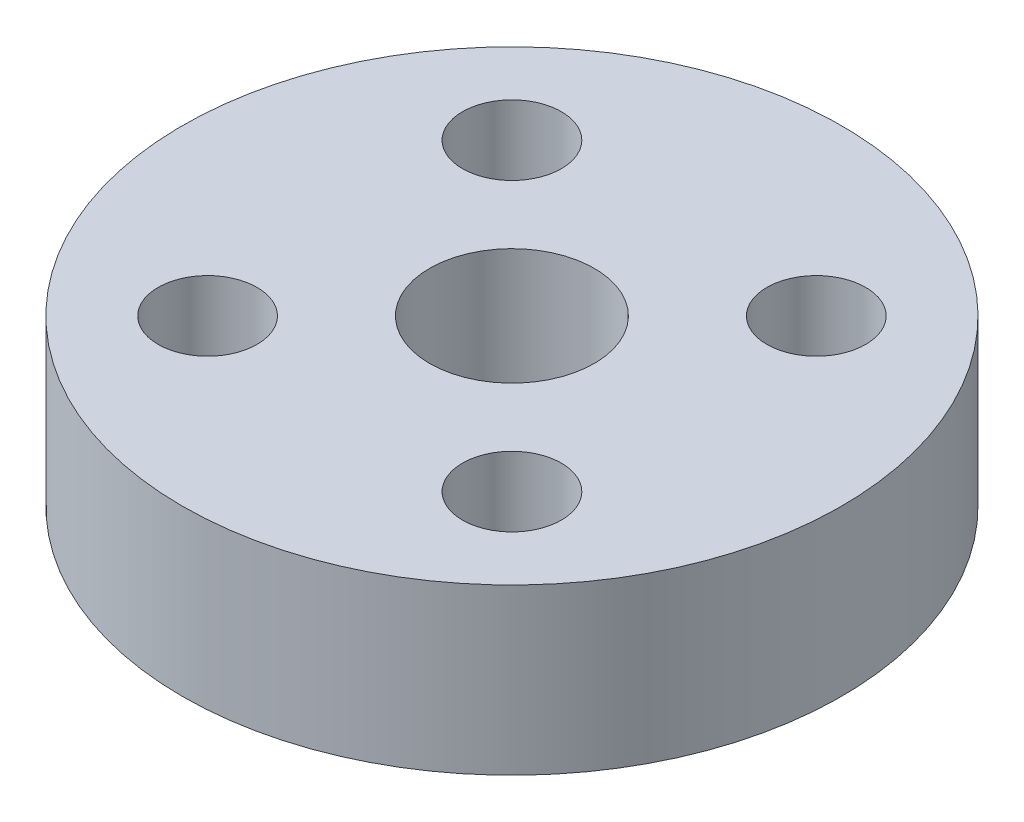
ISO-10303-21;
HEADER;
FILE_DESCRIPTION(('STEP AP214'),'2;1');
FILE_NAME('part.step','',(''),(''),'','','');
FILE_SCHEMA(('AUTOMOTIVE_DESIGN { 1 0 10303 214 1 1 1 1 }'));
ENDSEC;
DATA;
#1=APPLICATION_CONTEXT('core data for automotive mechanical design processes');
#2=APPLICATION_PROTOCOL_DEFINITION('international standard','automotive_design',2000,#1);
#3=PRODUCT_CONTEXT('',#1,'mechanical');
#4=PRODUCT('Part','Part','',(#3));
#5=PRODUCT_RELATED_PRODUCT_CATEGORY('part','',(#4));
#6=PRODUCT_DEFINITION_FORMATION('','',#4);
#7=PRODUCT_DEFINITION_CONTEXT('part definition',#1,'design');
#8=PRODUCT_DEFINITION('design','',#6,#7);
#9=PRODUCT_DEFINITION_SHAPE('','',#8);
#10=(LENGTH_UNIT() NAMED_UNIT(*) SI_UNIT(.MILLI.,.METRE.));
#11=(NAMED_UNIT(*) PLANE_ANGLE_UNIT() SI_UNIT($,.RADIAN.));
#12=(NAMED_UNIT(*) SI_UNIT($,.STERADIAN.) SOLID_ANGLE_UNIT());
#13=UNCERTAINTY_MEASURE_WITH_UNIT(LENGTH_MEASURE(1.E-05),#10,'distance_accuracy_value','');
#14=(GEOMETRIC_REPRESENTATION_CONTEXT(3) GLOBAL_UNCERTAINTY_ASSIGNED_CONTEXT((#13)) GLOBAL_UNIT_ASSIGNED_CONTEXT((#10,
#11,#12)) REPRESENTATION_CONTEXT('',''));
#15=CARTESIAN_POINT('',(0.,0.,0.));
#16=DIRECTION('',(0.,0.,1.));
#17=DIRECTION('',(1.,0.,0.));
#18=AXIS2_PLACEMENT_3D('',#15,#16,#17);
#19=CARTESIAN_POINT('',(-4.61740728114789,5.,4.61740728114842));
#20=DIRECTION('',(0.,-1.,0.));
#21=DIRECTION('',(0.,0.,-1.));
#22=AXIS2_PLACEMENT_3D('',#19,#20,#21);
#23=CYLINDRICAL_SURFACE('',#22,1.50000000000019);
#24=CARTESIAN_POINT('',(-4.61740728114789,5.,4.61740728114842));
#25=DIRECTION('',(0.,1.,0.));
#26=DIRECTION('',(0.,0.,1.));
#27=AXIS2_PLACEMENT_3D('',#24,#25,#26);
#28=CIRCLE('',#27,1.50000000000019);
#29=CARTESIAN_POINT('',(-4.61740728114789,5.,6.11740728114861));
#30=VERTEX_POINT('',#29);
#31=EDGE_CURVE('E40',#30,#30,#28,.T.);
#32=ORIENTED_EDGE('',*,*,#31,.T.);
#33=EDGE_LOOP('',(#32));
#34=FACE_BOUND('',#33,.T.);
#35=CARTESIAN_POINT('',(-4.61740728114789,0.,4.61740728114842));
#36=DIRECTION('',(0.,1.,0.));
#37=DIRECTION('',(0.,0.,1.));
#38=AXIS2_PLACEMENT_3D('',#35,#36,#37);
#39=CIRCLE('',#38,1.50000000000019);
#40=CARTESIAN_POINT('',(-4.61740728114789,0.,6.11740728114861));
#41=VERTEX_POINT('',#40);
#42=EDGE_CURVE('E60',#41,#41,#39,.T.);
#43=ORIENTED_EDGE('',*,*,#42,.F.);
#44=EDGE_LOOP('',(#43));
#45=FACE_BOUND('',#44,.T.);
#46=ADVANCED_FACE('F32',(#34,#45),#23,.F.);
#47=CARTESIAN_POINT('',(-4.61740728114816,5.,-4.61740728114789));
#48=DIRECTION('',(0.,-1.,0.));
#49=DIRECTION('',(0.,0.,-1.));
#50=AXIS2_PLACEMENT_3D('',#47,#48,#49);
#51=CYLINDRICAL_SURFACE('',#50,1.50000000000028);
#52=CARTESIAN_POINT('',(-4.61740728114816,5.,-4.61740728114789));
#53=DIRECTION('',(0.,1.,0.));
#54=DIRECTION('',(0.,0.,1.));
#55=AXIS2_PLACEMENT_3D('',#52,#53,#54);
#56=CIRCLE('',#55,1.50000000000028);
#57=CARTESIAN_POINT('',(-4.61740728114816,5.,-3.11740728114761));
#58=VERTEX_POINT('',#57);
#59=EDGE_CURVE('E45',#58,#58,#56,.T.);
#60=ORIENTED_EDGE('',*,*,#59,.T.);
#61=EDGE_LOOP('',(#60));
#62=FACE_BOUND('',#61,.T.);
#63=CARTESIAN_POINT('',(-4.61740728114816,0.,-4.61740728114789));
#64=DIRECTION('',(0.,1.,0.));
#65=DIRECTION('',(0.,0.,1.));
#66=AXIS2_PLACEMENT_3D('',#63,#64,#65);
#67=CIRCLE('',#66,1.50000000000028);
#68=CARTESIAN_POINT('',(-4.61740728114816,0.,-3.11740728114761));
#69=VERTEX_POINT('',#68);
#70=EDGE_CURVE('E58',#69,#69,#67,.T.);
#71=ORIENTED_EDGE('',*,*,#70,.F.);
#72=EDGE_LOOP('',(#71));
#73=FACE_BOUND('',#72,.T.);
#74=ADVANCED_FACE('F81',(#62,#73),#51,.F.);
#75=CARTESIAN_POINT('',(0.,5.,0.));
#76=DIRECTION('',(0.,-1.,0.));
#77=DIRECTION('',(0.,0.,-1.));
#78=AXIS2_PLACEMENT_3D('',#75,#76,#77);
#79=CYLINDRICAL_SURFACE('',#78,2.5);
#80=CARTESIAN_POINT('',(0.,5.,0.));
#81=DIRECTION('',(0.,1.,0.));
#82=DIRECTION('',(0.,0.,1.));
#83=AXIS2_PLACEMENT_3D('',#80,#81,#82);
#84=CIRCLE('',#83,2.5);
#85=CARTESIAN_POINT('',(0.,5.,2.5));
#86=VERTEX_POINT('',#85);
#87=EDGE_CURVE('E74',#86,#86,#84,.T.);
#88=ORIENTED_EDGE('',*,*,#87,.T.);
#89=EDGE_LOOP('',(#88));
#90=FACE_BOUND('',#89,.T.);
#91=CARTESIAN_POINT('',(0.,0.,0.));
#92=DIRECTION('',(0.,1.,0.));
#93=DIRECTION('',(0.,0.,1.));
#94=AXIS2_PLACEMENT_3D('',#91,#92,#93);
#95=CIRCLE('',#94,2.5);
#96=CARTESIAN_POINT('',(0.,0.,2.5));
#97=VERTEX_POINT('',#96);
#98=EDGE_CURVE('E55',#97,#97,#95,.T.);
#99=ORIENTED_EDGE('',*,*,#98,.F.);
#100=EDGE_LOOP('',(#99));
#101=FACE_BOUND('',#100,.T.);
#102=ADVANCED_FACE('F99',(#90,#101),#79,.F.);
#103=CARTESIAN_POINT('',(4.61740728114815,5.,-4.61740728114816));
#104=DIRECTION('',(0.,-1.,0.));
#105=DIRECTION('',(0.,0.,-1.));
#106=AXIS2_PLACEMENT_3D('',#103,#104,#105);
#107=CYLINDRICAL_SURFACE('',#106,1.5);
#108=CARTESIAN_POINT('',(4.61740728114815,5.,-4.61740728114816));
#109=DIRECTION('',(0.,1.,0.));
#110=DIRECTION('',(0.,0.,1.));
#111=AXIS2_PLACEMENT_3D('',#108,#109,#110);
#112=CIRCLE('',#111,1.5);
#113=CARTESIAN_POINT('',(4.61740728114815,5.,-3.11740728114816));
#114=VERTEX_POINT('',#113);
#115=EDGE_CURVE('E69',#114,#114,#112,.T.);
#116=ORIENTED_EDGE('',*,*,#115,.T.);
#117=EDGE_LOOP('',(#116));
#118=FACE_BOUND('',#117,.T.);
#119=CARTESIAN_POINT('',(4.61740728114815,0.,-4.61740728114816));
#120=DIRECTION('',(0.,1.,0.));
#121=DIRECTION('',(0.,0.,1.));
#122=AXIS2_PLACEMENT_3D('',#119,#120,#121);
#123=CIRCLE('',#122,1.5);
#124=CARTESIAN_POINT('',(4.61740728114815,0.,-3.11740728114816));
#125=VERTEX_POINT('',#124);
#126=EDGE_CURVE('E52',#125,#125,#123,.T.);
#127=ORIENTED_EDGE('',*,*,#126,.F.);
#128=EDGE_LOOP('',(#127));
#129=FACE_BOUND('',#128,.T.);
#130=ADVANCED_FACE('F105',(#118,#129),#107,.F.);
#131=CARTESIAN_POINT('',(0.,5.,0.));
#132=DIRECTION('',(0.,-1.,0.));
#133=DIRECTION('',(0.,0.,-1.));
#134=AXIS2_PLACEMENT_3D('',#131,#132,#133);
#135=CYLINDRICAL_SURFACE('',#134,10.);
#136=CARTESIAN_POINT('',(0.,5.,0.));
#137=DIRECTION('',(0.,1.,0.));
#138=DIRECTION('',(0.,0.,1.));
#139=AXIS2_PLACEMENT_3D('',#136,#137,#138);
#140=CIRCLE('',#139,10.);
#141=CARTESIAN_POINT('',(0.,5.,10.));
#142=VERTEX_POINT('',#141);
#143=EDGE_CURVE('E65',#142,#142,#140,.T.);
#144=ORIENTED_EDGE('',*,*,#143,.F.);
#145=EDGE_LOOP('',(#144));
#146=FACE_BOUND('',#145,.T.);
#147=CARTESIAN_POINT('',(0.,0.,0.));
#148=DIRECTION('',(0.,1.,0.));
#149=DIRECTION('',(0.,0.,1.));
#150=AXIS2_PLACEMENT_3D('',#147,#148,#149);
#151=CIRCLE('',#150,10.);
#152=CARTESIAN_POINT('',(0.,0.,10.));
#153=VERTEX_POINT('',#152);
#154=EDGE_CURVE('E49',#153,#153,#151,.T.);
#155=ORIENTED_EDGE('',*,*,#154,.T.);
#156=EDGE_LOOP('',(#155));
#157=FACE_BOUND('',#156,.T.);
#158=ADVANCED_FACE('F34',(#146,#157),#135,.T.);
#159=CARTESIAN_POINT('',(4.61740728114842,5.,4.61740728114815));
#160=DIRECTION('',(0.,-1.,0.));
#161=DIRECTION('',(0.,0.,-1.));
#162=AXIS2_PLACEMENT_3D('',#159,#160,#161);
#163=CYLINDRICAL_SURFACE('',#162,1.49999999999994);
#164=CARTESIAN_POINT('',(4.61740728114842,5.,4.61740728114815));
#165=DIRECTION('',(0.,1.,0.));
#166=DIRECTION('',(0.,0.,1.));
#167=AXIS2_PLACEMENT_3D('',#164,#165,#166);
#168=CIRCLE('',#167,1.49999999999994);
#169=CARTESIAN_POINT('',(4.61740728114842,5.,6.11740728114809));
#170=VERTEX_POINT('',#169);
#171=EDGE_CURVE('E10',#170,#170,#168,.T.);
#172=ORIENTED_EDGE('',*,*,#171,.T.);
#173=EDGE_LOOP('',(#172));
#174=FACE_BOUND('',#173,.T.);
#175=CARTESIAN_POINT('',(4.61740728114842,0.,4.61740728114815));
#176=DIRECTION('',(0.,1.,0.));
#177=DIRECTION('',(0.,0.,1.));
#178=AXIS2_PLACEMENT_3D('',#175,#176,#177);
#179=CIRCLE('',#178,1.49999999999994);
#180=CARTESIAN_POINT('',(4.61740728114842,0.,6.11740728114809));
#181=VERTEX_POINT('',#180);
#182=EDGE_CURVE('E36',#181,#181,#179,.T.);
#183=ORIENTED_EDGE('',*,*,#182,.F.);
#184=EDGE_LOOP('',(#183));
#185=FACE_BOUND('',#184,.T.);
#186=ADVANCED_FACE('F88',(#174,#185),#163,.F.);
#187=CARTESIAN_POINT('',(0.,5.,0.));
#188=DIRECTION('',(0.,1.,0.));
#189=DIRECTION('',(0.,0.,1.));
#190=AXIS2_PLACEMENT_3D('',#187,#188,#189);
#191=PLANE('',#190);
#192=ORIENTED_EDGE('',*,*,#143,.T.);
#193=EDGE_LOOP('',(#192));
#194=FACE_BOUND('',#193,.T.);
#195=ORIENTED_EDGE('',*,*,#115,.F.);
#196=EDGE_LOOP('',(#195));
#197=FACE_BOUND('',#196,.T.);
#198=ORIENTED_EDGE('',*,*,#87,.F.);
#199=EDGE_LOOP('',(#198));
#200=FACE_BOUND('',#199,.T.);
#201=ORIENTED_EDGE('',*,*,#59,.F.);
#202=EDGE_LOOP('',(#201));
#203=FACE_BOUND('',#202,.T.);
#204=ORIENTED_EDGE('',*,*,#31,.F.);
#205=EDGE_LOOP('',(#204));
#206=FACE_BOUND('',#205,.T.);
#207=ORIENTED_EDGE('',*,*,#171,.F.);
#208=EDGE_LOOP('',(#207));
#209=FACE_BOUND('',#208,.T.);
#210=ADVANCED_FACE('F84',(#194,#197,#200,#203,#206,#209),#191,.T.);
#211=CARTESIAN_POINT('',(0.,0.,0.));
#212=DIRECTION('',(0.,1.,0.));
#213=DIRECTION('',(0.,0.,1.));
#214=AXIS2_PLACEMENT_3D('',#211,#212,#213);
#215=PLANE('',#214);
#216=ORIENTED_EDGE('',*,*,#154,.F.);
#217=EDGE_LOOP('',(#216));
#218=FACE_BOUND('',#217,.T.);
#219=ORIENTED_EDGE('',*,*,#126,.T.);
#220=EDGE_LOOP('',(#219));
#221=FACE_BOUND('',#220,.T.);
#222=ORIENTED_EDGE('',*,*,#98,.T.);
#223=EDGE_LOOP('',(#222));
#224=FACE_BOUND('',#223,.T.);
#225=ORIENTED_EDGE('',*,*,#70,.T.);
#226=EDGE_LOOP('',(#225));
#227=FACE_BOUND('',#226,.T.);
#228=ORIENTED_EDGE('',*,*,#42,.T.);
#229=EDGE_LOOP('',(#228));
#230=FACE_BOUND('',#229,.T.);
#231=ORIENTED_EDGE('',*,*,#182,.T.);
#232=EDGE_LOOP('',(#231));
#233=FACE_BOUND('',#232,.T.);
#234=ADVANCED_FACE('F87',(#218,#221,#224,#227,#230,#233),#215,.F.);
#235=CLOSED_SHELL('',(#46,#74,#102,#130,#158,#186,#210,#234));
#236=MANIFOLD_SOLID_BREP('B2',#235);
#237=ADVANCED_BREP_SHAPE_REPRESENTATION('',(#18,#236),#14);
#238=SHAPE_DEFINITION_REPRESENTATION(#9,#237);
ENDSEC;
END-ISO-10303-21;
